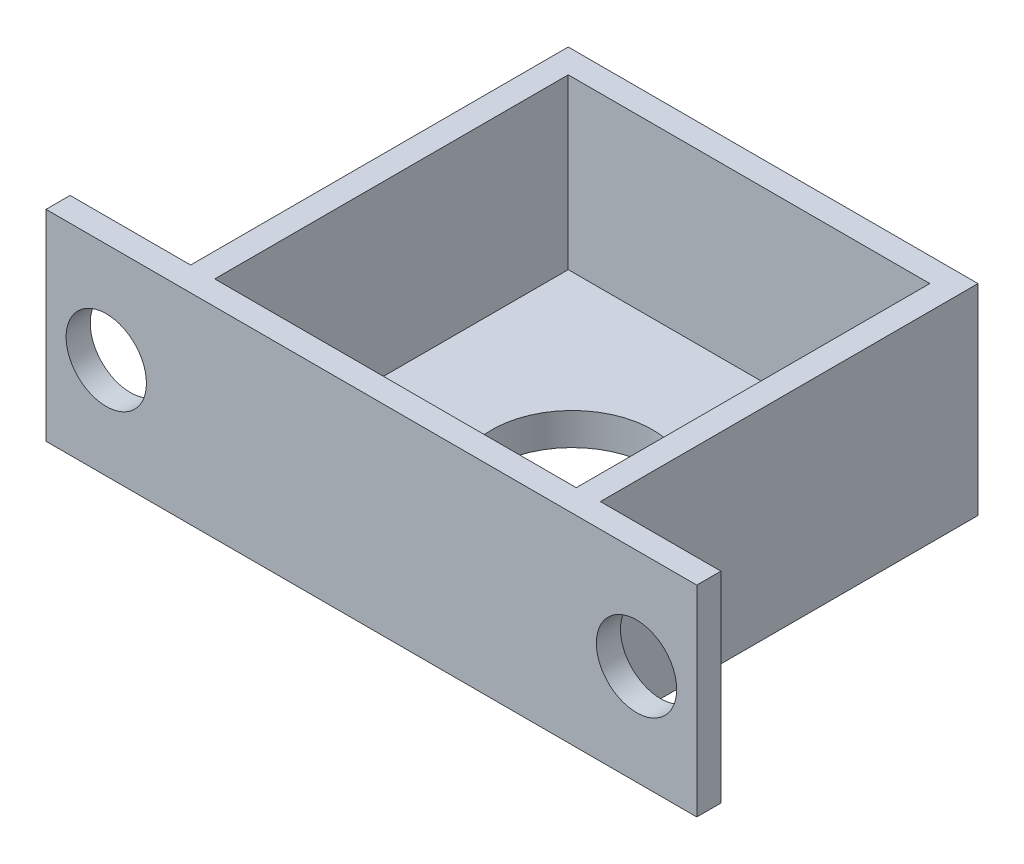
ISO-10303-21;
HEADER;
FILE_DESCRIPTION(('STEP AP214'),'2;1');
FILE_NAME('part.step','',(''),(''),'','','');
FILE_SCHEMA(('AUTOMOTIVE_DESIGN { 1 0 10303 214 1 1 1 1 }'));
ENDSEC;
DATA;
#1=APPLICATION_CONTEXT('core data for automotive mechanical design processes');
#2=APPLICATION_PROTOCOL_DEFINITION('international standard','automotive_design',2000,#1);
#3=PRODUCT_CONTEXT('',#1,'mechanical');
#4=PRODUCT('Part','Part','',(#3));
#5=PRODUCT_RELATED_PRODUCT_CATEGORY('part','',(#4));
#6=PRODUCT_DEFINITION_FORMATION('','',#4);
#7=PRODUCT_DEFINITION_CONTEXT('part definition',#1,'design');
#8=PRODUCT_DEFINITION('design','',#6,#7);
#9=PRODUCT_DEFINITION_SHAPE('','',#8);
#10=(LENGTH_UNIT() NAMED_UNIT(*) SI_UNIT(.MILLI.,.METRE.));
#11=(NAMED_UNIT(*) PLANE_ANGLE_UNIT() SI_UNIT($,.RADIAN.));
#12=(NAMED_UNIT(*) SI_UNIT($,.STERADIAN.) SOLID_ANGLE_UNIT());
#13=UNCERTAINTY_MEASURE_WITH_UNIT(LENGTH_MEASURE(1.E-05),#10,'distance_accuracy_value','');
#14=(GEOMETRIC_REPRESENTATION_CONTEXT(3) GLOBAL_UNCERTAINTY_ASSIGNED_CONTEXT((#13)) GLOBAL_UNIT_ASSIGNED_CONTEXT((#10,
#11,#12)) REPRESENTATION_CONTEXT('',''));
#15=CARTESIAN_POINT('',(0.,0.,0.));
#16=DIRECTION('',(0.,0.,1.));
#17=DIRECTION('',(1.,0.,0.));
#18=AXIS2_PLACEMENT_3D('',#15,#16,#17);
#19=CARTESIAN_POINT('',(0.,0.,0.));
#20=DIRECTION('',(0.,1.,0.));
#21=DIRECTION('',(0.,0.,1.));
#22=AXIS2_PLACEMENT_3D('',#19,#20,#21);
#23=CYLINDRICAL_SURFACE('',#22,10.);
#24=CARTESIAN_POINT('',(0.,0.,0.));
#25=DIRECTION('',(0.,1.,0.));
#26=DIRECTION('',(0.,0.,1.));
#27=AXIS2_PLACEMENT_3D('',#24,#25,#26);
#28=CIRCLE('',#27,10.);
#29=CARTESIAN_POINT('',(0.,0.,10.));
#30=VERTEX_POINT('',#29);
#31=EDGE_CURVE('E205',#30,#30,#28,.T.);
#32=ORIENTED_EDGE('',*,*,#31,.F.);
#33=EDGE_LOOP('',(#32));
#34=FACE_BOUND('',#33,.T.);
#35=CARTESIAN_POINT('',(0.,4.,0.));
#36=DIRECTION('',(0.,1.,0.));
#37=DIRECTION('',(0.,0.,1.));
#38=AXIS2_PLACEMENT_3D('',#35,#36,#37);
#39=CIRCLE('',#38,10.);
#40=CARTESIAN_POINT('',(0.,4.,10.));
#41=VERTEX_POINT('',#40);
#42=EDGE_CURVE('E37',#41,#41,#39,.F.);
#43=ORIENTED_EDGE('',*,*,#42,.F.);
#44=EDGE_LOOP('',(#43));
#45=FACE_BOUND('',#44,.T.);
#46=ADVANCED_FACE('F33',(#34,#45),#23,.F.);
#47=CARTESIAN_POINT('',(25.5,25.,-25.));
#48=DIRECTION('',(-1.,0.,0.));
#49=DIRECTION('',(0.,0.,1.));
#50=AXIS2_PLACEMENT_3D('',#47,#48,#49);
#51=PLANE('',#50);
#52=DIRECTION('',(0.,0.,-1.));
#53=VECTOR('',#52,1.);
#54=CARTESIAN_POINT('',(25.5,25.,-25.));
#55=LINE('',#54,#53);
#56=CARTESIAN_POINT('',(25.5,25.,22.));
#57=VERTEX_POINT('',#56);
#58=CARTESIAN_POINT('',(25.5,25.,-25.));
#59=VERTEX_POINT('',#58);
#60=EDGE_CURVE('E136',#57,#59,#55,.T.);
#61=ORIENTED_EDGE('',*,*,#60,.F.);
#62=DIRECTION('',(0.,-1.,0.));
#63=VECTOR('',#62,1.);
#64=CARTESIAN_POINT('',(25.5,25.,22.));
#65=LINE('',#64,#63);
#66=CARTESIAN_POINT('',(25.5,0.,22.));
#67=VERTEX_POINT('',#66);
#68=EDGE_CURVE('E171',#57,#67,#65,.T.);
#69=ORIENTED_EDGE('',*,*,#68,.T.);
#70=DIRECTION('',(0.,0.,-1.));
#71=VECTOR('',#70,1.);
#72=CARTESIAN_POINT('',(25.5,0.,-25.));
#73=LINE('',#72,#71);
#74=CARTESIAN_POINT('',(25.5,0.,-25.));
#75=VERTEX_POINT('',#74);
#76=EDGE_CURVE('E208',#67,#75,#73,.T.);
#77=ORIENTED_EDGE('',*,*,#76,.T.);
#78=DIRECTION('',(0.,-1.,0.));
#79=VECTOR('',#78,1.);
#80=CARTESIAN_POINT('',(25.5,25.,-25.));
#81=LINE('',#80,#79);
#82=EDGE_CURVE('E11',#59,#75,#81,.T.);
#83=ORIENTED_EDGE('',*,*,#82,.F.);
#84=EDGE_LOOP('',(#61,#69,#77,#83));
#85=FACE_BOUND('',#84,.T.);
#86=ADVANCED_FACE('F35',(#85),#51,.F.);
#87=CARTESIAN_POINT('',(-25.5,25.,-25.));
#88=DIRECTION('',(0.,0.,1.));
#89=DIRECTION('',(1.,0.,0.));
#90=AXIS2_PLACEMENT_3D('',#87,#88,#89);
#91=PLANE('',#90);
#92=DIRECTION('',(-1.,0.,0.));
#93=VECTOR('',#92,1.);
#94=CARTESIAN_POINT('',(-25.5,0.,-25.));
#95=LINE('',#94,#93);
#96=CARTESIAN_POINT('',(-25.5,0.,-25.));
#97=VERTEX_POINT('',#96);
#98=EDGE_CURVE('E218',#75,#97,#95,.T.);
#99=ORIENTED_EDGE('',*,*,#98,.T.);
#100=DIRECTION('',(0.,-1.,0.));
#101=VECTOR('',#100,1.);
#102=CARTESIAN_POINT('',(-25.5,25.,-25.));
#103=LINE('',#102,#101);
#104=CARTESIAN_POINT('',(-25.5,25.,-25.));
#105=VERTEX_POINT('',#104);
#106=EDGE_CURVE('E42',#105,#97,#103,.T.);
#107=ORIENTED_EDGE('',*,*,#106,.F.);
#108=DIRECTION('',(-1.,0.,0.));
#109=VECTOR('',#108,1.);
#110=CARTESIAN_POINT('',(-25.5,25.,-25.));
#111=LINE('',#110,#109);
#112=EDGE_CURVE('E210',#59,#105,#111,.T.);
#113=ORIENTED_EDGE('',*,*,#112,.F.);
#114=ORIENTED_EDGE('',*,*,#82,.T.);
#115=EDGE_LOOP('',(#99,#107,#113,#114));
#116=FACE_BOUND('',#115,.T.);
#117=ADVANCED_FACE('F240',(#116),#91,.F.);
#118=CARTESIAN_POINT('',(-25.5,25.,-25.));
#119=DIRECTION('',(1.,0.,0.));
#120=DIRECTION('',(0.,0.,-1.));
#121=AXIS2_PLACEMENT_3D('',#118,#119,#120);
#122=PLANE('',#121);
#123=DIRECTION('',(0.,0.,1.));
#124=VECTOR('',#123,1.);
#125=CARTESIAN_POINT('',(-25.5,0.,-25.));
#126=LINE('',#125,#124);
#127=CARTESIAN_POINT('',(-25.5,0.,22.));
#128=VERTEX_POINT('',#127);
#129=EDGE_CURVE('E137',#97,#128,#126,.T.);
#130=ORIENTED_EDGE('',*,*,#129,.T.);
#131=DIRECTION('',(0.,1.,0.));
#132=VECTOR('',#131,1.);
#133=CARTESIAN_POINT('',(-25.5,25.,22.));
#134=LINE('',#133,#132);
#135=CARTESIAN_POINT('',(-25.5,25.,22.));
#136=VERTEX_POINT('',#135);
#137=EDGE_CURVE('E166',#128,#136,#134,.T.);
#138=ORIENTED_EDGE('',*,*,#137,.T.);
#139=DIRECTION('',(0.,0.,1.));
#140=VECTOR('',#139,1.);
#141=CARTESIAN_POINT('',(-25.5,25.,-25.));
#142=LINE('',#141,#140);
#143=EDGE_CURVE('E212',#105,#136,#142,.T.);
#144=ORIENTED_EDGE('',*,*,#143,.F.);
#145=ORIENTED_EDGE('',*,*,#106,.T.);
#146=EDGE_LOOP('',(#130,#138,#144,#145));
#147=FACE_BOUND('',#146,.T.);
#148=ADVANCED_FACE('F227',(#147),#122,.F.);
#149=CARTESIAN_POINT('',(-25.5,25.,25.));
#150=DIRECTION('',(0.,0.,-1.));
#151=DIRECTION('',(-1.,0.,0.));
#152=AXIS2_PLACEMENT_3D('',#149,#150,#151);
#153=PLANE('',#152);
#154=DIRECTION('',(1.,0.,0.));
#155=VECTOR('',#154,1.);
#156=CARTESIAN_POINT('',(-25.5,0.,25.));
#157=LINE('',#156,#155);
#158=CARTESIAN_POINT('',(-40.5,0.,25.));
#159=VERTEX_POINT('',#158);
#160=CARTESIAN_POINT('',(40.5,0.,25.));
#161=VERTEX_POINT('',#160);
#162=EDGE_CURVE('E125',#159,#161,#157,.T.);
#163=ORIENTED_EDGE('',*,*,#162,.T.);
#164=DIRECTION('',(0.,-1.,0.));
#165=VECTOR('',#164,1.);
#166=CARTESIAN_POINT('',(40.5,25.,25.));
#167=LINE('',#166,#165);
#168=CARTESIAN_POINT('',(40.5,25.,25.));
#169=VERTEX_POINT('',#168);
#170=EDGE_CURVE('E130',#169,#161,#167,.T.);
#171=ORIENTED_EDGE('',*,*,#170,.F.);
#172=DIRECTION('',(1.,0.,0.));
#173=VECTOR('',#172,1.);
#174=CARTESIAN_POINT('',(-25.5,25.,25.));
#175=LINE('',#174,#173);
#176=CARTESIAN_POINT('',(-40.5,25.,25.));
#177=VERTEX_POINT('',#176);
#178=EDGE_CURVE('E215',#177,#169,#175,.T.);
#179=ORIENTED_EDGE('',*,*,#178,.F.);
#180=DIRECTION('',(0.,1.,0.));
#181=VECTOR('',#180,1.);
#182=CARTESIAN_POINT('',(-40.5,25.,25.));
#183=LINE('',#182,#181);
#184=EDGE_CURVE('E132',#159,#177,#183,.T.);
#185=ORIENTED_EDGE('',*,*,#184,.F.);
#186=EDGE_LOOP('',(#163,#171,#179,#185));
#187=FACE_BOUND('',#186,.T.);
#188=CARTESIAN_POINT('',(-33.,12.5,25.));
#189=DIRECTION('',(0.,0.,-1.));
#190=DIRECTION('',(1.,0.,0.));
#191=AXIS2_PLACEMENT_3D('',#188,#189,#190);
#192=CIRCLE('',#191,4.99999999999999);
#193=CARTESIAN_POINT('',(-28.,12.5,25.));
#194=VERTEX_POINT('',#193);
#195=EDGE_CURVE('E391',#194,#194,#192,.T.);
#196=ORIENTED_EDGE('',*,*,#195,.T.);
#197=EDGE_LOOP('',(#196));
#198=FACE_BOUND('',#197,.T.);
#199=CARTESIAN_POINT('',(33.,12.5,25.));
#200=DIRECTION('',(0.,0.,-1.));
#201=DIRECTION('',(-1.,0.,0.));
#202=AXIS2_PLACEMENT_3D('',#199,#200,#201);
#203=CIRCLE('',#202,5.);
#204=CARTESIAN_POINT('',(28.,12.5,25.));
#205=VERTEX_POINT('',#204);
#206=EDGE_CURVE('E161',#205,#205,#203,.T.);
#207=ORIENTED_EDGE('',*,*,#206,.T.);
#208=EDGE_LOOP('',(#207));
#209=FACE_BOUND('',#208,.T.);
#210=ADVANCED_FACE('F127',(#187,#198,#209),#153,.F.);
#211=CARTESIAN_POINT('',(0.,25.,0.));
#212=DIRECTION('',(0.,1.,0.));
#213=DIRECTION('',(0.,0.,1.));
#214=AXIS2_PLACEMENT_3D('',#211,#212,#213);
#215=PLANE('',#214);
#216=DIRECTION('',(0.,0.,-1.));
#217=VECTOR('',#216,1.);
#218=CARTESIAN_POINT('',(22.5,25.,-22.));
#219=LINE('',#218,#217);
#220=CARTESIAN_POINT('',(22.5,25.,22.));
#221=VERTEX_POINT('',#220);
#222=CARTESIAN_POINT('',(22.5,25.,-22.));
#223=VERTEX_POINT('',#222);
#224=EDGE_CURVE('E173',#221,#223,#219,.T.);
#225=ORIENTED_EDGE('',*,*,#224,.F.);
#226=DIRECTION('',(1.,0.,0.));
#227=VECTOR('',#226,1.);
#228=CARTESIAN_POINT('',(-22.5,25.,22.));
#229=LINE('',#228,#227);
#230=CARTESIAN_POINT('',(-22.5,25.,22.));
#231=VERTEX_POINT('',#230);
#232=EDGE_CURVE('E178',#231,#221,#229,.T.);
#233=ORIENTED_EDGE('',*,*,#232,.F.);
#234=DIRECTION('',(0.,0.,1.));
#235=VECTOR('',#234,1.);
#236=CARTESIAN_POINT('',(-22.5,25.,-22.));
#237=LINE('',#236,#235);
#238=CARTESIAN_POINT('',(-22.5,25.,-22.));
#239=VERTEX_POINT('',#238);
#240=EDGE_CURVE('E192',#239,#231,#237,.T.);
#241=ORIENTED_EDGE('',*,*,#240,.F.);
#242=DIRECTION('',(-1.,0.,0.));
#243=VECTOR('',#242,1.);
#244=CARTESIAN_POINT('',(-22.5,25.,-22.));
#245=LINE('',#244,#243);
#246=EDGE_CURVE('E189',#223,#239,#245,.T.);
#247=ORIENTED_EDGE('',*,*,#246,.F.);
#248=EDGE_LOOP('',(#225,#233,#241,#247));
#249=FACE_BOUND('',#248,.T.);
#250=ORIENTED_EDGE('',*,*,#178,.T.);
#251=DIRECTION('',(0.,0.,-1.));
#252=VECTOR('',#251,1.);
#253=CARTESIAN_POINT('',(40.5,25.,25.));
#254=LINE('',#253,#252);
#255=CARTESIAN_POINT('',(40.5,25.,22.));
#256=VERTEX_POINT('',#255);
#257=EDGE_CURVE('E149',#169,#256,#254,.T.);
#258=ORIENTED_EDGE('',*,*,#257,.T.);
#259=DIRECTION('',(1.,0.,0.));
#260=VECTOR('',#259,1.);
#261=CARTESIAN_POINT('',(40.5,25.,22.));
#262=LINE('',#261,#260);
#263=EDGE_CURVE('E152',#57,#256,#262,.T.);
#264=ORIENTED_EDGE('',*,*,#263,.F.);
#265=ORIENTED_EDGE('',*,*,#60,.T.);
#266=ORIENTED_EDGE('',*,*,#112,.T.);
#267=ORIENTED_EDGE('',*,*,#143,.T.);
#268=CARTESIAN_POINT('',(-40.5,25.,22.));
#269=VERTEX_POINT('',#268);
#270=EDGE_CURVE('E49',#269,#136,#262,.T.);
#271=ORIENTED_EDGE('',*,*,#270,.F.);
#272=DIRECTION('',(0.,0.,-1.));
#273=VECTOR('',#272,1.);
#274=CARTESIAN_POINT('',(-40.5,25.,25.));
#275=LINE('',#274,#273);
#276=EDGE_CURVE('E167',#177,#269,#275,.T.);
#277=ORIENTED_EDGE('',*,*,#276,.F.);
#278=EDGE_LOOP('',(#250,#258,#264,#265,#266,#267,#271,#277));
#279=FACE_BOUND('',#278,.T.);
#280=ADVANCED_FACE('F235',(#249,#279),#215,.T.);
#281=CARTESIAN_POINT('',(0.,0.,0.));
#282=DIRECTION('',(0.,1.,0.));
#283=DIRECTION('',(0.,0.,1.));
#284=AXIS2_PLACEMENT_3D('',#281,#282,#283);
#285=PLANE('',#284);
#286=ORIENTED_EDGE('',*,*,#31,.T.);
#287=EDGE_LOOP('',(#286));
#288=FACE_BOUND('',#287,.T.);
#289=ORIENTED_EDGE('',*,*,#76,.F.);
#290=DIRECTION('',(-1.,0.,0.));
#291=VECTOR('',#290,1.);
#292=CARTESIAN_POINT('',(40.5,0.,22.));
#293=LINE('',#292,#291);
#294=CARTESIAN_POINT('',(40.5,0.,22.));
#295=VERTEX_POINT('',#294);
#296=EDGE_CURVE('E57',#295,#67,#293,.T.);
#297=ORIENTED_EDGE('',*,*,#296,.F.);
#298=DIRECTION('',(0.,0.,-1.));
#299=VECTOR('',#298,1.);
#300=CARTESIAN_POINT('',(40.5,0.,25.));
#301=LINE('',#300,#299);
#302=EDGE_CURVE('E139',#161,#295,#301,.T.);
#303=ORIENTED_EDGE('',*,*,#302,.F.);
#304=ORIENTED_EDGE('',*,*,#162,.F.);
#305=DIRECTION('',(0.,0.,-1.));
#306=VECTOR('',#305,1.);
#307=CARTESIAN_POINT('',(-40.5,0.,25.));
#308=LINE('',#307,#306);
#309=CARTESIAN_POINT('',(-40.5,0.,22.));
#310=VERTEX_POINT('',#309);
#311=EDGE_CURVE('E144',#159,#310,#308,.T.);
#312=ORIENTED_EDGE('',*,*,#311,.T.);
#313=EDGE_CURVE('E160',#128,#310,#293,.T.);
#314=ORIENTED_EDGE('',*,*,#313,.F.);
#315=ORIENTED_EDGE('',*,*,#129,.F.);
#316=ORIENTED_EDGE('',*,*,#98,.F.);
#317=EDGE_LOOP('',(#289,#297,#303,#304,#312,#314,#315,#316));
#318=FACE_BOUND('',#317,.T.);
#319=ADVANCED_FACE('F141',(#288,#318),#285,.F.);
#320=CARTESIAN_POINT('',(0.,4.,0.));
#321=DIRECTION('',(0.,1.,0.));
#322=DIRECTION('',(0.,0.,1.));
#323=AXIS2_PLACEMENT_3D('',#320,#321,#322);
#324=PLANE('',#323);
#325=DIRECTION('',(0.,0.,-1.));
#326=VECTOR('',#325,1.);
#327=CARTESIAN_POINT('',(22.5,4.,-22.));
#328=LINE('',#327,#326);
#329=CARTESIAN_POINT('',(22.5,4.,22.));
#330=VERTEX_POINT('',#329);
#331=CARTESIAN_POINT('',(22.5,4.,-22.));
#332=VERTEX_POINT('',#331);
#333=EDGE_CURVE('E174',#330,#332,#328,.T.);
#334=ORIENTED_EDGE('',*,*,#333,.T.);
#335=DIRECTION('',(-1.,0.,0.));
#336=VECTOR('',#335,1.);
#337=CARTESIAN_POINT('',(-22.5,4.,-22.));
#338=LINE('',#337,#336);
#339=CARTESIAN_POINT('',(-22.5,4.,-22.));
#340=VERTEX_POINT('',#339);
#341=EDGE_CURVE('E177',#332,#340,#338,.T.);
#342=ORIENTED_EDGE('',*,*,#341,.T.);
#343=DIRECTION('',(0.,0.,1.));
#344=VECTOR('',#343,1.);
#345=CARTESIAN_POINT('',(-22.5,4.,-22.));
#346=LINE('',#345,#344);
#347=CARTESIAN_POINT('',(-22.5,4.,22.));
#348=VERTEX_POINT('',#347);
#349=EDGE_CURVE('E181',#340,#348,#346,.T.);
#350=ORIENTED_EDGE('',*,*,#349,.T.);
#351=DIRECTION('',(1.,0.,0.));
#352=VECTOR('',#351,1.);
#353=CARTESIAN_POINT('',(-22.5,4.,22.));
#354=LINE('',#353,#352);
#355=EDGE_CURVE('E184',#348,#330,#354,.T.);
#356=ORIENTED_EDGE('',*,*,#355,.T.);
#357=EDGE_LOOP('',(#334,#342,#350,#356));
#358=FACE_BOUND('',#357,.T.);
#359=ORIENTED_EDGE('',*,*,#42,.T.);
#360=EDGE_LOOP('',(#359));
#361=FACE_BOUND('',#360,.T.);
#362=ADVANCED_FACE('F277',(#358,#361),#324,.T.);
#363=CARTESIAN_POINT('',(22.5,4.,-22.));
#364=DIRECTION('',(1.,0.,0.));
#365=DIRECTION('',(0.,0.,-1.));
#366=AXIS2_PLACEMENT_3D('',#363,#364,#365);
#367=PLANE('',#366);
#368=ORIENTED_EDGE('',*,*,#224,.T.);
#369=DIRECTION('',(0.,1.,0.));
#370=VECTOR('',#369,1.);
#371=CARTESIAN_POINT('',(22.5,4.,-22.));
#372=LINE('',#371,#370);
#373=EDGE_CURVE('E187',#332,#223,#372,.T.);
#374=ORIENTED_EDGE('',*,*,#373,.F.);
#375=ORIENTED_EDGE('',*,*,#333,.F.);
#376=DIRECTION('',(0.,1.,0.));
#377=VECTOR('',#376,1.);
#378=CARTESIAN_POINT('',(22.5,4.,22.));
#379=LINE('',#378,#377);
#380=EDGE_CURVE('E197',#330,#221,#379,.T.);
#381=ORIENTED_EDGE('',*,*,#380,.T.);
#382=EDGE_LOOP('',(#368,#374,#375,#381));
#383=FACE_BOUND('',#382,.T.);
#384=ADVANCED_FACE('F272',(#383),#367,.F.);
#385=CARTESIAN_POINT('',(-22.5,4.,22.));
#386=DIRECTION('',(0.,0.,1.));
#387=DIRECTION('',(1.,0.,0.));
#388=AXIS2_PLACEMENT_3D('',#385,#386,#387);
#389=PLANE('',#388);
#390=ORIENTED_EDGE('',*,*,#232,.T.);
#391=ORIENTED_EDGE('',*,*,#380,.F.);
#392=ORIENTED_EDGE('',*,*,#355,.F.);
#393=DIRECTION('',(0.,1.,0.));
#394=VECTOR('',#393,1.);
#395=CARTESIAN_POINT('',(-22.5,4.,22.));
#396=LINE('',#395,#394);
#397=EDGE_CURVE('E199',#348,#231,#396,.T.);
#398=ORIENTED_EDGE('',*,*,#397,.T.);
#399=EDGE_LOOP('',(#390,#391,#392,#398));
#400=FACE_BOUND('',#399,.T.);
#401=ADVANCED_FACE('F308',(#400),#389,.F.);
#402=CARTESIAN_POINT('',(-22.5,4.,-22.));
#403=DIRECTION('',(-1.,0.,0.));
#404=DIRECTION('',(0.,0.,1.));
#405=AXIS2_PLACEMENT_3D('',#402,#403,#404);
#406=PLANE('',#405);
#407=ORIENTED_EDGE('',*,*,#240,.T.);
#408=ORIENTED_EDGE('',*,*,#397,.F.);
#409=ORIENTED_EDGE('',*,*,#349,.F.);
#410=DIRECTION('',(0.,1.,0.));
#411=VECTOR('',#410,1.);
#412=CARTESIAN_POINT('',(-22.5,4.,-22.));
#413=LINE('',#412,#411);
#414=EDGE_CURVE('E201',#340,#239,#413,.T.);
#415=ORIENTED_EDGE('',*,*,#414,.T.);
#416=EDGE_LOOP('',(#407,#408,#409,#415));
#417=FACE_BOUND('',#416,.T.);
#418=ADVANCED_FACE('F256',(#417),#406,.F.);
#419=CARTESIAN_POINT('',(-22.5,4.,-22.));
#420=DIRECTION('',(0.,0.,-1.));
#421=DIRECTION('',(-1.,0.,0.));
#422=AXIS2_PLACEMENT_3D('',#419,#420,#421);
#423=PLANE('',#422);
#424=ORIENTED_EDGE('',*,*,#246,.T.);
#425=ORIENTED_EDGE('',*,*,#414,.F.);
#426=ORIENTED_EDGE('',*,*,#341,.F.);
#427=ORIENTED_EDGE('',*,*,#373,.T.);
#428=EDGE_LOOP('',(#424,#425,#426,#427));
#429=FACE_BOUND('',#428,.T.);
#430=ADVANCED_FACE('F247',(#429),#423,.F.);
#431=CARTESIAN_POINT('',(-40.5,25.,25.));
#432=DIRECTION('',(-1.,0.,0.));
#433=DIRECTION('',(0.,-1.,0.));
#434=AXIS2_PLACEMENT_3D('',#431,#432,#433);
#435=PLANE('',#434);
#436=DIRECTION('',(0.,1.,0.));
#437=VECTOR('',#436,1.);
#438=CARTESIAN_POINT('',(-40.5,25.,22.));
#439=LINE('',#438,#437);
#440=EDGE_CURVE('E163',#310,#269,#439,.T.);
#441=ORIENTED_EDGE('',*,*,#440,.F.);
#442=ORIENTED_EDGE('',*,*,#311,.F.);
#443=ORIENTED_EDGE('',*,*,#184,.T.);
#444=ORIENTED_EDGE('',*,*,#276,.T.);
#445=EDGE_LOOP('',(#441,#442,#443,#444));
#446=FACE_BOUND('',#445,.T.);
#447=ADVANCED_FACE('F244',(#446),#435,.T.);
#448=CARTESIAN_POINT('',(-33.,12.5,25.));
#449=DIRECTION('',(0.,0.,-1.));
#450=DIRECTION('',(-1.,0.,0.));
#451=AXIS2_PLACEMENT_3D('',#448,#449,#450);
#452=CYLINDRICAL_SURFACE('',#451,4.99999999999999);
#453=ORIENTED_EDGE('',*,*,#195,.F.);
#454=EDGE_LOOP('',(#453));
#455=FACE_BOUND('',#454,.T.);
#456=CARTESIAN_POINT('',(-33.,12.5,22.));
#457=DIRECTION('',(0.,0.,-1.));
#458=DIRECTION('',(1.,0.,0.));
#459=AXIS2_PLACEMENT_3D('',#456,#457,#458);
#460=CIRCLE('',#459,4.99999999999999);
#461=CARTESIAN_POINT('',(-28.,12.5,22.));
#462=VERTEX_POINT('',#461);
#463=EDGE_CURVE('E393',#462,#462,#460,.T.);
#464=ORIENTED_EDGE('',*,*,#463,.T.);
#465=EDGE_LOOP('',(#464));
#466=FACE_BOUND('',#465,.T.);
#467=ADVANCED_FACE('F246',(#455,#466),#452,.F.);
#468=CARTESIAN_POINT('',(0.,0.,22.));
#469=DIRECTION('',(0.,0.,-1.));
#470=DIRECTION('',(-1.,0.,0.));
#471=AXIS2_PLACEMENT_3D('',#468,#469,#470);
#472=PLANE('',#471);
#473=ORIENTED_EDGE('',*,*,#463,.F.);
#474=EDGE_LOOP('',(#473));
#475=FACE_BOUND('',#474,.T.);
#476=ORIENTED_EDGE('',*,*,#137,.F.);
#477=ORIENTED_EDGE('',*,*,#313,.T.);
#478=ORIENTED_EDGE('',*,*,#440,.T.);
#479=ORIENTED_EDGE('',*,*,#270,.T.);
#480=EDGE_LOOP('',(#476,#477,#478,#479));
#481=FACE_BOUND('',#480,.T.);
#482=ADVANCED_FACE('F233',(#475,#481),#472,.T.);
#483=CARTESIAN_POINT('',(33.,12.5,22.));
#484=DIRECTION('',(0.,0.,-1.));
#485=DIRECTION('',(-1.,0.,0.));
#486=AXIS2_PLACEMENT_3D('',#483,#484,#485);
#487=CIRCLE('',#486,5.);
#488=CARTESIAN_POINT('',(28.,12.5,22.));
#489=VERTEX_POINT('',#488);
#490=EDGE_CURVE('E155',#489,#489,#487,.T.);
#491=ORIENTED_EDGE('',*,*,#490,.F.);
#492=EDGE_LOOP('',(#491));
#493=FACE_BOUND('',#492,.T.);
#494=ORIENTED_EDGE('',*,*,#68,.F.);
#495=ORIENTED_EDGE('',*,*,#263,.T.);
#496=DIRECTION('',(0.,-1.,0.));
#497=VECTOR('',#496,1.);
#498=CARTESIAN_POINT('',(40.5,25.,22.));
#499=LINE('',#498,#497);
#500=EDGE_CURVE('E158',#256,#295,#499,.T.);
#501=ORIENTED_EDGE('',*,*,#500,.T.);
#502=ORIENTED_EDGE('',*,*,#296,.T.);
#503=EDGE_LOOP('',(#494,#495,#501,#502));
#504=FACE_BOUND('',#503,.T.);
#505=ADVANCED_FACE('F242',(#493,#504),#472,.T.);
#506=CARTESIAN_POINT('',(40.5,25.,25.));
#507=DIRECTION('',(1.,0.,0.));
#508=DIRECTION('',(0.,1.,0.));
#509=AXIS2_PLACEMENT_3D('',#506,#507,#508);
#510=PLANE('',#509);
#511=ORIENTED_EDGE('',*,*,#500,.F.);
#512=ORIENTED_EDGE('',*,*,#257,.F.);
#513=ORIENTED_EDGE('',*,*,#170,.T.);
#514=ORIENTED_EDGE('',*,*,#302,.T.);
#515=EDGE_LOOP('',(#511,#512,#513,#514));
#516=FACE_BOUND('',#515,.T.);
#517=ADVANCED_FACE('F147',(#516),#510,.T.);
#518=CARTESIAN_POINT('',(33.,12.5,25.));
#519=DIRECTION('',(0.,0.,-1.));
#520=DIRECTION('',(-1.,0.,0.));
#521=AXIS2_PLACEMENT_3D('',#518,#519,#520);
#522=CYLINDRICAL_SURFACE('',#521,5.);
#523=ORIENTED_EDGE('',*,*,#206,.F.);
#524=EDGE_LOOP('',(#523));
#525=FACE_BOUND('',#524,.T.);
#526=ORIENTED_EDGE('',*,*,#490,.T.);
#527=EDGE_LOOP('',(#526));
#528=FACE_BOUND('',#527,.T.);
#529=ADVANCED_FACE('F374',(#525,#528),#522,.F.);
#530=CLOSED_SHELL('',(#46,#86,#117,#148,#210,#280,#319,#362,#384,#401,#418,#430,#447,#467,#482,
#505,#517,#529));
#531=MANIFOLD_SOLID_BREP('B2',#530);
#532=ADVANCED_BREP_SHAPE_REPRESENTATION('',(#18,#531),#14);
#533=SHAPE_DEFINITION_REPRESENTATION(#9,#532);
ENDSEC;
END-ISO-10303-21;
